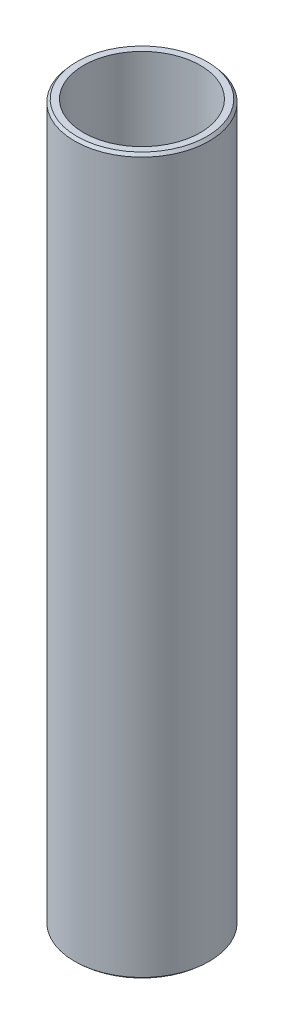
ISO-10303-21;
HEADER;
FILE_DESCRIPTION(('STEP AP214'),'2;1');
FILE_NAME('part.step','',(''),(''),'','','');
FILE_SCHEMA(('AUTOMOTIVE_DESIGN { 1 0 10303 214 1 1 1 1 }'));
ENDSEC;
DATA;
#1=APPLICATION_CONTEXT('core data for automotive mechanical design processes');
#2=APPLICATION_PROTOCOL_DEFINITION('international standard','automotive_design',2000,#1);
#3=PRODUCT_CONTEXT('',#1,'mechanical');
#4=PRODUCT('Part','Part','',(#3));
#5=PRODUCT_RELATED_PRODUCT_CATEGORY('part','',(#4));
#6=PRODUCT_DEFINITION_FORMATION('','',#4);
#7=PRODUCT_DEFINITION_CONTEXT('part definition',#1,'design');
#8=PRODUCT_DEFINITION('design','',#6,#7);
#9=PRODUCT_DEFINITION_SHAPE('','',#8);
#10=(LENGTH_UNIT() NAMED_UNIT(*) SI_UNIT(.MILLI.,.METRE.));
#11=(NAMED_UNIT(*) PLANE_ANGLE_UNIT() SI_UNIT($,.RADIAN.));
#12=(NAMED_UNIT(*) SI_UNIT($,.STERADIAN.) SOLID_ANGLE_UNIT());
#13=UNCERTAINTY_MEASURE_WITH_UNIT(LENGTH_MEASURE(1.E-05),#10,'distance_accuracy_value','');
#14=(GEOMETRIC_REPRESENTATION_CONTEXT(3) GLOBAL_UNCERTAINTY_ASSIGNED_CONTEXT((#13)) GLOBAL_UNIT_ASSIGNED_CONTEXT((#10,
#11,#12)) REPRESENTATION_CONTEXT('',''));
#15=CARTESIAN_POINT('',(0.,0.,0.));
#16=DIRECTION('',(0.,0.,1.));
#17=DIRECTION('',(1.,0.,0.));
#18=AXIS2_PLACEMENT_3D('',#15,#16,#17);
#19=CARTESIAN_POINT('',(0.,584.367279120836,0.));
#20=DIRECTION('',(0.,-1.,0.));
#21=DIRECTION('',(0.,0.,-1.));
#22=AXIS2_PLACEMENT_3D('',#19,#20,#21);
#23=CYLINDRICAL_SURFACE('',#22,55.);
#24=CARTESIAN_POINT('',(0.,582.127251046133,0.));
#25=DIRECTION('',(0.,1.,0.));
#26=DIRECTION('',(0.,0.,1.));
#27=AXIS2_PLACEMENT_3D('',#24,#25,#26);
#28=CIRCLE('',#27,55.);
#29=CARTESIAN_POINT('',(0.,582.127251046133,55.));
#30=VERTEX_POINT('',#29);
#31=EDGE_CURVE('E50',#30,#30,#28,.F.);
#32=ORIENTED_EDGE('',*,*,#31,.T.);
#33=EDGE_LOOP('',(#32));
#34=FACE_BOUND('',#33,.T.);
#35=CARTESIAN_POINT('',(0.,1.96739049762806,0.));
#36=DIRECTION('',(0.,1.,0.));
#37=DIRECTION('',(0.,0.,1.));
#38=AXIS2_PLACEMENT_3D('',#35,#36,#37);
#39=CIRCLE('',#38,55.);
#40=CARTESIAN_POINT('',(0.,1.96739049762806,55.));
#41=VERTEX_POINT('',#40);
#42=EDGE_CURVE('E51',#41,#41,#39,.T.);
#43=ORIENTED_EDGE('',*,*,#42,.T.);
#44=EDGE_LOOP('',(#43));
#45=FACE_BOUND('',#44,.T.);
#46=ADVANCED_FACE('F39',(#34,#45),#23,.T.);
#47=CARTESIAN_POINT('',(0.,584.367279120836,0.));
#48=DIRECTION('',(0.,1.,0.));
#49=DIRECTION('',(0.,0.,1.));
#50=AXIS2_PLACEMENT_3D('',#47,#48,#49);
#51=PLANE('',#50);
#52=CARTESIAN_POINT('',(0.,584.367279120836,0.));
#53=DIRECTION('',(0.,1.,0.));
#54=DIRECTION('',(0.,0.,1.));
#55=AXIS2_PLACEMENT_3D('',#52,#53,#54);
#56=CIRCLE('',#55,53.032609502372);
#57=CARTESIAN_POINT('',(0.,584.367279120836,53.032609502372));
#58=VERTEX_POINT('',#57);
#59=EDGE_CURVE('E54',#58,#58,#56,.T.);
#60=ORIENTED_EDGE('',*,*,#59,.T.);
#61=EDGE_LOOP('',(#60));
#62=FACE_BOUND('',#61,.T.);
#63=CARTESIAN_POINT('',(0.,584.367279120836,0.));
#64=DIRECTION('',(0.,1.,0.));
#65=DIRECTION('',(0.,0.,1.));
#66=AXIS2_PLACEMENT_3D('',#63,#64,#65);
#67=CIRCLE('',#66,47.6697317861074);
#68=CARTESIAN_POINT('',(0.,584.367279120836,47.6697317861074));
#69=VERTEX_POINT('',#68);
#70=EDGE_CURVE('E58',#69,#69,#67,.T.);
#71=ORIENTED_EDGE('',*,*,#70,.F.);
#72=EDGE_LOOP('',(#71));
#73=FACE_BOUND('',#72,.T.);
#74=ADVANCED_FACE('F69',(#62,#73),#51,.T.);
#75=CARTESIAN_POINT('',(0.,0.,0.));
#76=DIRECTION('',(0.,1.,0.));
#77=DIRECTION('',(0.,0.,1.));
#78=AXIS2_PLACEMENT_3D('',#75,#76,#77);
#79=PLANE('',#78);
#80=CARTESIAN_POINT('',(0.,0.,0.));
#81=DIRECTION('',(0.,1.,0.));
#82=DIRECTION('',(0.,0.,1.));
#83=AXIS2_PLACEMENT_3D('',#80,#81,#82);
#84=CIRCLE('',#83,52.7599719252972);
#85=CARTESIAN_POINT('',(0.,0.,52.7599719252972));
#86=VERTEX_POINT('',#85);
#87=EDGE_CURVE('E10',#86,#86,#84,.F.);
#88=ORIENTED_EDGE('',*,*,#87,.T.);
#89=EDGE_LOOP('',(#88));
#90=FACE_BOUND('',#89,.T.);
#91=CARTESIAN_POINT('',(0.,0.,0.));
#92=DIRECTION('',(0.,1.,0.));
#93=DIRECTION('',(0.,0.,1.));
#94=AXIS2_PLACEMENT_3D('',#91,#92,#93);
#95=CIRCLE('',#94,47.6697317861074);
#96=CARTESIAN_POINT('',(0.,0.,47.6697317861074));
#97=VERTEX_POINT('',#96);
#98=EDGE_CURVE('E63',#97,#97,#95,.T.);
#99=ORIENTED_EDGE('',*,*,#98,.T.);
#100=EDGE_LOOP('',(#99));
#101=FACE_BOUND('',#100,.T.);
#102=ADVANCED_FACE('F75',(#90,#101),#79,.F.);
#103=CARTESIAN_POINT('',(0.,584.367279120836,0.));
#104=DIRECTION('',(0.,-1.,0.));
#105=DIRECTION('',(0.,0.,-1.));
#106=AXIS2_PLACEMENT_3D('',#103,#104,#105);
#107=CYLINDRICAL_SURFACE('',#106,47.6697317861074);
#108=ORIENTED_EDGE('',*,*,#70,.T.);
#109=EDGE_LOOP('',(#108));
#110=FACE_BOUND('',#109,.T.);
#111=ORIENTED_EDGE('',*,*,#98,.F.);
#112=EDGE_LOOP('',(#111));
#113=FACE_BOUND('',#112,.T.);
#114=ADVANCED_FACE('F70',(#110,#113),#107,.F.);
#115=CARTESIAN_POINT('',(0.,584.367279120836,0.));
#116=DIRECTION('',(0.,-1.,0.));
#117=DIRECTION('',(0.,0.,-1.));
#118=AXIS2_PLACEMENT_3D('',#115,#116,#117);
#119=CONICAL_SURFACE('',#118,53.032609502372,0.720689379532589);
#120=ORIENTED_EDGE('',*,*,#31,.F.);
#121=EDGE_LOOP('',(#120));
#122=FACE_BOUND('',#121,.T.);
#123=ORIENTED_EDGE('',*,*,#59,.F.);
#124=EDGE_LOOP('',(#123));
#125=FACE_BOUND('',#124,.T.);
#126=ADVANCED_FACE('F81',(#122,#125),#119,.T.);
#127=CARTESIAN_POINT('',(0.,1.96739049762806,0.));
#128=DIRECTION('',(0.,1.,0.));
#129=DIRECTION('',(0.,0.,1.));
#130=AXIS2_PLACEMENT_3D('',#127,#128,#129);
#131=CONICAL_SURFACE('',#130,55.,0.850106947262309);
#132=ORIENTED_EDGE('',*,*,#87,.F.);
#133=EDGE_LOOP('',(#132));
#134=FACE_BOUND('',#133,.T.);
#135=ORIENTED_EDGE('',*,*,#42,.F.);
#136=EDGE_LOOP('',(#135));
#137=FACE_BOUND('',#136,.T.);
#138=ADVANCED_FACE('F45',(#134,#137),#131,.T.);
#139=CLOSED_SHELL('',(#46,#74,#102,#114,#126,#138));
#140=MANIFOLD_SOLID_BREP('B2',#139);
#141=ADVANCED_BREP_SHAPE_REPRESENTATION('',(#18,#140),#14);
#142=SHAPE_DEFINITION_REPRESENTATION(#9,#141);
ENDSEC;
END-ISO-10303-21;
